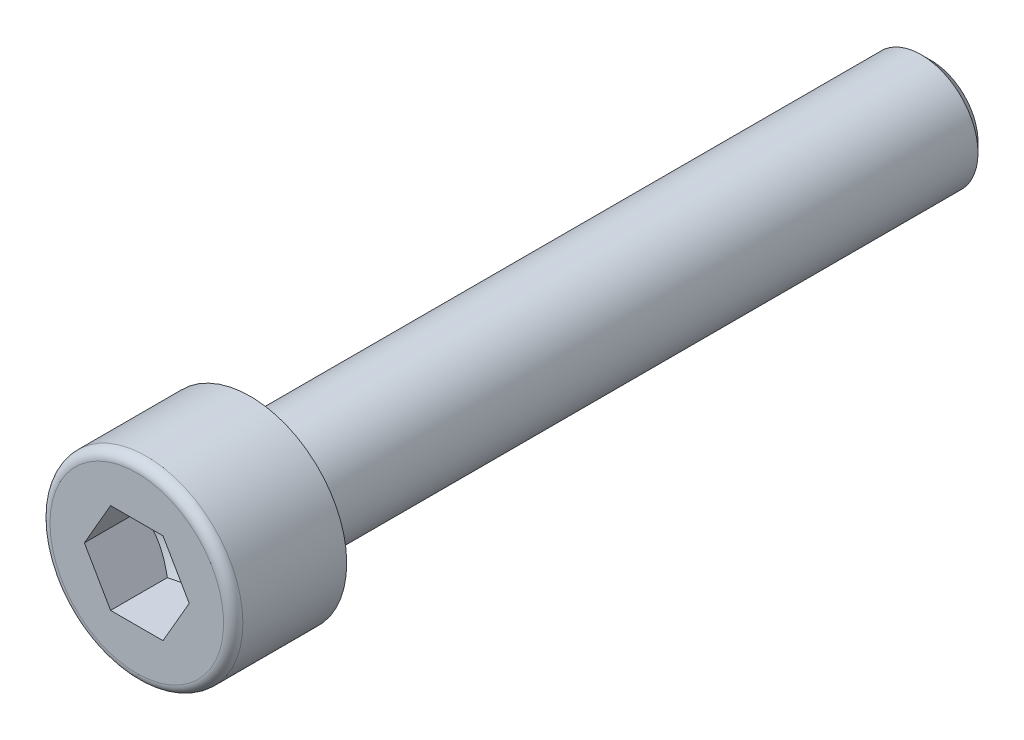
ISO-10303-21;
HEADER;
FILE_DESCRIPTION(('STEP AP214'),'2;1');
FILE_NAME('part.step','',(''),(''),'','','');
FILE_SCHEMA(('AUTOMOTIVE_DESIGN { 1 0 10303 214 1 1 1 1 }'));
ENDSEC;
DATA;
#1=APPLICATION_CONTEXT('core data for automotive mechanical design processes');
#2=APPLICATION_PROTOCOL_DEFINITION('international standard','automotive_design',2000,#1);
#3=PRODUCT_CONTEXT('',#1,'mechanical');
#4=PRODUCT('Part','Part','',(#3));
#5=PRODUCT_RELATED_PRODUCT_CATEGORY('part','',(#4));
#6=PRODUCT_DEFINITION_FORMATION('','',#4);
#7=PRODUCT_DEFINITION_CONTEXT('part definition',#1,'design');
#8=PRODUCT_DEFINITION('design','',#6,#7);
#9=PRODUCT_DEFINITION_SHAPE('','',#8);
#10=(LENGTH_UNIT() NAMED_UNIT(*) SI_UNIT(.MILLI.,.METRE.));
#11=(NAMED_UNIT(*) PLANE_ANGLE_UNIT() SI_UNIT($,.RADIAN.));
#12=(NAMED_UNIT(*) SI_UNIT($,.STERADIAN.) SOLID_ANGLE_UNIT());
#13=UNCERTAINTY_MEASURE_WITH_UNIT(LENGTH_MEASURE(1.E-05),#10,'distance_accuracy_value','');
#14=(GEOMETRIC_REPRESENTATION_CONTEXT(3) GLOBAL_UNCERTAINTY_ASSIGNED_CONTEXT((#13)) GLOBAL_UNIT_ASSIGNED_CONTEXT((#10,
#11,#12)) REPRESENTATION_CONTEXT('',''));
#15=CARTESIAN_POINT('',(0.,0.,0.));
#16=DIRECTION('',(0.,0.,1.));
#17=DIRECTION('',(1.,0.,0.));
#18=AXIS2_PLACEMENT_3D('',#15,#16,#17);
#19=CARTESIAN_POINT('',(0.,3.825,5.));
#20=DIRECTION('',(0.,0.,-1.));
#21=DIRECTION('',(-1.,0.,0.));
#22=AXIS2_PLACEMENT_3D('',#19,#20,#21);
#23=PLANE('',#22);
#24=CARTESIAN_POINT('',(0.,0.,5.));
#25=DIRECTION('',(0.,0.,-1.));
#26=DIRECTION('',(-1.,0.,0.));
#27=AXIS2_PLACEMENT_3D('',#24,#25,#26);
#28=CIRCLE('',#27,3.825);
#29=CARTESIAN_POINT('',(-3.825,0.,5.));
#30=VERTEX_POINT('',#29);
#31=EDGE_CURVE('E51',#30,#30,#28,.F.);
#32=ORIENTED_EDGE('',*,*,#31,.T.);
#33=EDGE_LOOP('',(#32));
#34=FACE_BOUND('',#33,.T.);
#35=DIRECTION('',(0.5,-0.866025403784439,0.));
#36=VECTOR('',#35,1.);
#37=CARTESIAN_POINT('',(1.1547,1.99999906749978,5.));
#38=LINE('',#37,#36);
#39=CARTESIAN_POINT('',(1.1547,1.99999906749978,5.));
#40=VERTEX_POINT('',#39);
#41=CARTESIAN_POINT('',(2.3094,0.,5.));
#42=VERTEX_POINT('',#41);
#43=EDGE_CURVE('E58',#40,#42,#38,.T.);
#44=ORIENTED_EDGE('',*,*,#43,.T.);
#45=DIRECTION('',(-0.5,-0.866025403784439,0.));
#46=VECTOR('',#45,1.);
#47=CARTESIAN_POINT('',(2.3094,0.,5.));
#48=LINE('',#47,#46);
#49=CARTESIAN_POINT('',(1.1547,-1.99999906749978,5.));
#50=VERTEX_POINT('',#49);
#51=EDGE_CURVE('E190',#42,#50,#48,.T.);
#52=ORIENTED_EDGE('',*,*,#51,.T.);
#53=DIRECTION('',(-1.,0.,0.));
#54=VECTOR('',#53,1.);
#55=CARTESIAN_POINT('',(1.1547,-1.99999906749978,5.));
#56=LINE('',#55,#54);
#57=CARTESIAN_POINT('',(-1.1547,-1.99999906749978,5.));
#58=VERTEX_POINT('',#57);
#59=EDGE_CURVE('E466',#50,#58,#56,.T.);
#60=ORIENTED_EDGE('',*,*,#59,.T.);
#61=DIRECTION('',(-0.5,0.866025403784439,0.));
#62=VECTOR('',#61,1.);
#63=CARTESIAN_POINT('',(-1.1547,-1.99999906749978,5.));
#64=LINE('',#63,#62);
#65=CARTESIAN_POINT('',(-2.3094,0.,5.));
#66=VERTEX_POINT('',#65);
#67=EDGE_CURVE('E472',#58,#66,#64,.T.);
#68=ORIENTED_EDGE('',*,*,#67,.T.);
#69=DIRECTION('',(0.5,0.866025403784439,0.));
#70=VECTOR('',#69,1.);
#71=CARTESIAN_POINT('',(-2.3094,0.,5.));
#72=LINE('',#71,#70);
#73=CARTESIAN_POINT('',(-1.1547,1.99999906749978,5.));
#74=VERTEX_POINT('',#73);
#75=EDGE_CURVE('E129',#66,#74,#72,.T.);
#76=ORIENTED_EDGE('',*,*,#75,.T.);
#77=DIRECTION('',(1.,0.,0.));
#78=VECTOR('',#77,1.);
#79=CARTESIAN_POINT('',(-1.1547,1.99999906749978,5.));
#80=LINE('',#79,#78);
#81=EDGE_CURVE('E121',#74,#40,#80,.T.);
#82=ORIENTED_EDGE('',*,*,#81,.T.);
#83=EDGE_LOOP('',(#44,#52,#60,#68,#76,#82));
#84=FACE_BOUND('',#83,.T.);
#85=ADVANCED_FACE('F43',(#34,#84),#23,.F.);
#86=CARTESIAN_POINT('',(0.,0.,0.));
#87=DIRECTION('',(0.,0.,1.));
#88=DIRECTION('',(1.,0.,0.));
#89=AXIS2_PLACEMENT_3D('',#86,#87,#88);
#90=PLANE('',#89);
#91=CARTESIAN_POINT('',(0.,0.,0.));
#92=DIRECTION('',(0.,0.,1.));
#93=DIRECTION('',(1.,0.,0.));
#94=AXIS2_PLACEMENT_3D('',#91,#92,#93);
#95=CIRCLE('',#94,4.25);
#96=CARTESIAN_POINT('',(4.25,0.,0.));
#97=VERTEX_POINT('',#96);
#98=EDGE_CURVE('E145',#97,#97,#95,.T.);
#99=ORIENTED_EDGE('',*,*,#98,.F.);
#100=EDGE_LOOP('',(#99));
#101=FACE_BOUND('',#100,.T.);
#102=CARTESIAN_POINT('',(0.,0.,0.));
#103=DIRECTION('',(0.,0.,1.));
#104=DIRECTION('',(1.,0.,0.));
#105=AXIS2_PLACEMENT_3D('',#102,#103,#104);
#106=CIRCLE('',#105,2.5);
#107=CARTESIAN_POINT('',(2.5,0.,0.));
#108=VERTEX_POINT('',#107);
#109=EDGE_CURVE('E150',#108,#108,#106,.F.);
#110=ORIENTED_EDGE('',*,*,#109,.F.);
#111=EDGE_LOOP('',(#110));
#112=FACE_BOUND('',#111,.T.);
#113=ADVANCED_FACE('F245',(#101,#112),#90,.F.);
#114=CARTESIAN_POINT('',(0.,0.,5.));
#115=DIRECTION('',(0.,0.,1.));
#116=DIRECTION('',(1.,0.,0.));
#117=AXIS2_PLACEMENT_3D('',#114,#115,#116);
#118=CYLINDRICAL_SURFACE('',#117,4.25);
#119=CARTESIAN_POINT('',(0.,0.,4.575));
#120=DIRECTION('',(0.,0.,-1.));
#121=DIRECTION('',(-1.,0.,0.));
#122=AXIS2_PLACEMENT_3D('',#119,#120,#121);
#123=CIRCLE('',#122,4.25);
#124=CARTESIAN_POINT('',(-4.25,0.,4.575));
#125=VERTEX_POINT('',#124);
#126=EDGE_CURVE('E12',#125,#125,#123,.T.);
#127=ORIENTED_EDGE('',*,*,#126,.T.);
#128=EDGE_LOOP('',(#127));
#129=FACE_BOUND('',#128,.T.);
#130=ORIENTED_EDGE('',*,*,#98,.T.);
#131=EDGE_LOOP('',(#130));
#132=FACE_BOUND('',#131,.T.);
#133=ADVANCED_FACE('F251',(#129,#132),#118,.T.);
#134=CARTESIAN_POINT('',(0.,0.,0.));
#135=DIRECTION('',(0.,0.,1.));
#136=DIRECTION('',(1.,0.,0.));
#137=AXIS2_PLACEMENT_3D('',#134,#135,#136);
#138=CYLINDRICAL_SURFACE('',#137,2.5);
#139=ORIENTED_EDGE('',*,*,#109,.T.);
#140=EDGE_LOOP('',(#139));
#141=FACE_BOUND('',#140,.T.);
#142=CARTESIAN_POINT('',(0.,0.,-29.567));
#143=DIRECTION('',(0.,0.,-1.));
#144=DIRECTION('',(-1.,0.,0.));
#145=AXIS2_PLACEMENT_3D('',#142,#143,#144);
#146=CIRCLE('',#145,2.5);
#147=CARTESIAN_POINT('',(-2.5,0.,-29.567));
#148=VERTEX_POINT('',#147);
#149=EDGE_CURVE('E270',#148,#148,#146,.F.);
#150=ORIENTED_EDGE('',*,*,#149,.T.);
#151=EDGE_LOOP('',(#150));
#152=FACE_BOUND('',#151,.T.);
#153=ADVANCED_FACE('F243',(#141,#152),#138,.T.);
#154=CARTESIAN_POINT('',(1.1547,1.99999906749978,1.16666728833348));
#155=DIRECTION('',(-0.866025403784438,-0.5,0.));
#156=DIRECTION('',(-0.5,0.866025403784439,0.));
#157=AXIS2_PLACEMENT_3D('',#154,#155,#156);
#158=PLANE('',#157);
#159=DIRECTION('',(0.,0.,1.));
#160=VECTOR('',#159,1.);
#161=CARTESIAN_POINT('',(2.3094,0.,1.16666728833348));
#162=LINE('',#161,#160);
#163=CARTESIAN_POINT('',(2.3094,0.,2.5));
#164=VERTEX_POINT('',#163);
#165=EDGE_CURVE('E142',#164,#42,#162,.T.);
#166=ORIENTED_EDGE('',*,*,#165,.T.);
#167=ORIENTED_EDGE('',*,*,#43,.F.);
#168=DIRECTION('',(0.,0.,1.));
#169=VECTOR('',#168,1.);
#170=CARTESIAN_POINT('',(1.1547,1.99999906749978,1.16666728833348));
#171=LINE('',#170,#169);
#172=CARTESIAN_POINT('',(1.1547,1.99999906749978,2.5));
#173=VERTEX_POINT('',#172);
#174=EDGE_CURVE('E114',#173,#40,#171,.T.);
#175=ORIENTED_EDGE('',*,*,#174,.F.);
#176=CARTESIAN_POINT('',(2.30940115470054,-2.E-06,2.50000066666717));
#177=CARTESIAN_POINT('',(2.2586590633301,0.0878858803359065,2.4706961706999));
#178=CARTESIAN_POINT('',(2.20747896699173,0.176532407530229,2.44404525693772));
#179=CARTESIAN_POINT('',(2.10423262359364,0.355360319991423,2.39752686821321));
#180=CARTESIAN_POINT('',(2.05216454263161,0.445544881670277,2.37767584793047));
#181=CARTESIAN_POINT('',(1.94867363491875,0.624796391950368,2.3467762774357));
#182=CARTESIAN_POINT('',(1.8972667271894,0.713835767997602,2.33552204992335));
#183=CARTESIAN_POINT('',(1.79421114915164,0.89233326516239,2.32208931802634));
#184=CARTESIAN_POINT('',(1.74256285316985,0.981790737927202,2.31989968755767));
#185=CARTESIAN_POINT('',(1.64606340062569,1.14893269263626,2.32446629100991));
#186=CARTESIAN_POINT('',(1.60119776416565,1.22664225449897,2.33010127235949));
#187=CARTESIAN_POINT('',(1.51175877649126,1.38155512532854,2.34795730960129));
#188=CARTESIAN_POINT('',(1.46718573439589,1.45875789888563,2.36018445922001));
#189=CARTESIAN_POINT('',(1.37756249119973,1.61398990964047,2.39074999235722));
#190=CARTESIAN_POINT('',(1.33252362751513,1.69199950985737,2.40921788183297));
#191=CARTESIAN_POINT('',(1.2431174638359,1.84685552785963,2.45113219321949));
#192=CARTESIAN_POINT('',(1.19874901931202,1.92370392802778,2.47456877313832));
#193=CARTESIAN_POINT('',(1.15469884529946,2.00000106749979,2.50000066666717));
#194=B_SPLINE_CURVE_WITH_KNOTS('',3,(#176,#177,#178,#179,#180,#181,#182,#183,#184,#185,#186,
#187,#188,#189,#190,#191,#192,#193),.UNSPECIFIED.,.F.,.F.,(4,2,2,2,2,2,2,2,4),(0.,
0.317016021868475,0.634793841625281,0.944707629264745,1.2542409089752,1.52370869907371,
1.79342601033586,2.06912439061208,2.34428168581533),.UNSPECIFIED.);
#195=EDGE_CURVE('E106',#164,#173,#194,.T.);
#196=ORIENTED_EDGE('',*,*,#195,.F.);
#197=EDGE_LOOP('',(#166,#167,#175,#196));
#198=FACE_BOUND('',#197,.T.);
#199=ADVANCED_FACE('F115',(#198),#158,.T.);
#200=CARTESIAN_POINT('',(2.3094,0.,1.16666728833348));
#201=DIRECTION('',(-0.866025403784439,0.5,0.));
#202=DIRECTION('',(0.5,0.866025403784439,0.));
#203=AXIS2_PLACEMENT_3D('',#200,#201,#202);
#204=PLANE('',#203);
#205=DIRECTION('',(0.,0.,1.));
#206=VECTOR('',#205,1.);
#207=CARTESIAN_POINT('',(1.1547,-1.99999906749978,1.16666728833348));
#208=LINE('',#207,#206);
#209=CARTESIAN_POINT('',(1.1547,-1.99999906749978,2.5));
#210=VERTEX_POINT('',#209);
#211=EDGE_CURVE('E139',#210,#50,#208,.T.);
#212=ORIENTED_EDGE('',*,*,#211,.T.);
#213=ORIENTED_EDGE('',*,*,#51,.F.);
#214=ORIENTED_EDGE('',*,*,#165,.F.);
#215=CARTESIAN_POINT('',(1.15469884529946,-2.00000106749979,2.50000066666717));
#216=CARTESIAN_POINT('',(1.2054409366699,-1.91211318716388,2.4706961706999));
#217=CARTESIAN_POINT('',(1.25662103300827,-1.82346665996956,2.44404525693772));
#218=CARTESIAN_POINT('',(1.35986737640636,-1.64463874750836,2.39752686821321));
#219=CARTESIAN_POINT('',(1.41193545736839,-1.55445418582951,2.37767584793046));
#220=CARTESIAN_POINT('',(1.51542636508125,-1.37520267554942,2.3467762774357));
#221=CARTESIAN_POINT('',(1.5668332728106,-1.28616329950218,2.33552204992335));
#222=CARTESIAN_POINT('',(1.66988885084836,-1.10766580233739,2.32208931802633));
#223=CARTESIAN_POINT('',(1.72153714683015,-1.01820832957258,2.31989968755767));
#224=CARTESIAN_POINT('',(1.81803659937431,-0.851066374863522,2.32446629100991));
#225=CARTESIAN_POINT('',(1.86290223583435,-0.773356813000813,2.33010127235949));
#226=CARTESIAN_POINT('',(1.95234122350874,-0.618443942171244,2.34795730960128));
#227=CARTESIAN_POINT('',(1.99691426560411,-0.54124116861415,2.36018445922001));
#228=CARTESIAN_POINT('',(2.08653750880027,-0.386009157859311,2.39074999235722));
#229=CARTESIAN_POINT('',(2.13157637248487,-0.307999557642412,2.40921788183297));
#230=CARTESIAN_POINT('',(2.2209825361641,-0.153143539640155,2.45113219321949));
#231=CARTESIAN_POINT('',(2.26535098068798,-0.0762951394720057,2.47456877313831));
#232=CARTESIAN_POINT('',(2.30940115470054,1.99999999989533E-06,2.50000066666717));
#233=B_SPLINE_CURVE_WITH_KNOTS('',3,(#215,#216,#217,#218,#219,#220,#221,#222,#223,#224,#225,
#226,#227,#228,#229,#230,#231,#232),.UNSPECIFIED.,.F.,.F.,(4,2,2,2,2,2,2,2,4),(0.,
0.317016021868475,0.634793841625281,0.944707629264746,1.2542409089752,1.52370869907371,
1.79342601033586,2.06912439061208,2.34428168581533),.UNSPECIFIED.);
#234=EDGE_CURVE('E110',#210,#164,#233,.T.);
#235=ORIENTED_EDGE('',*,*,#234,.F.);
#236=EDGE_LOOP('',(#212,#213,#214,#235));
#237=FACE_BOUND('',#236,.T.);
#238=ADVANCED_FACE('F234',(#237),#204,.T.);
#239=CARTESIAN_POINT('',(1.1547,-1.99999906749978,1.16666728833348));
#240=DIRECTION('',(0.,1.,0.));
#241=DIRECTION('',(1.,0.,0.));
#242=AXIS2_PLACEMENT_3D('',#239,#240,#241);
#243=PLANE('',#242);
#244=DIRECTION('',(0.,0.,1.));
#245=VECTOR('',#244,1.);
#246=CARTESIAN_POINT('',(-1.1547,-1.99999906749978,1.16666728833348));
#247=LINE('',#246,#245);
#248=CARTESIAN_POINT('',(-1.1547,-1.99999906749978,2.5));
#249=VERTEX_POINT('',#248);
#250=EDGE_CURVE('E136',#249,#58,#247,.T.);
#251=ORIENTED_EDGE('',*,*,#250,.T.);
#252=ORIENTED_EDGE('',*,*,#59,.F.);
#253=ORIENTED_EDGE('',*,*,#211,.F.);
#254=CARTESIAN_POINT('',(-2.99028884971983,-1.99999906749978,3.24367023125859));
#255=CARTESIAN_POINT('',(-2.90392200266685,-1.99999906749978,3.20223468621355));
#256=CARTESIAN_POINT('',(-2.81734475420192,-1.99999906749978,3.16122952382548));
#257=CARTESIAN_POINT('',(-2.64365731596042,-1.99999906749978,3.08032411328961));
#258=CARTESIAN_POINT('',(-2.55654703367194,-1.99999906749978,3.04042406398872));
#259=CARTESIAN_POINT('',(-2.38118192431167,-1.99999906749978,2.96175012614929));
#260=CARTESIAN_POINT('',(-2.29292335976907,-1.99999906749978,2.92298453713559));
#261=CARTESIAN_POINT('',(-2.11566562283863,-1.99999906749978,2.84719170485446));
#262=CARTESIAN_POINT('',(-2.02666648924309,-1.99999906749978,2.81016437120063));
#263=CARTESIAN_POINT('',(-1.84544164627787,-1.99999906749978,2.73736806072605));
#264=CARTESIAN_POINT('',(-1.75319241539257,-1.99999906749978,2.70165729625577));
#265=CARTESIAN_POINT('',(-1.56757813216984,-1.99999906749978,2.6332047864779));
#266=CARTESIAN_POINT('',(-1.47421295183128,-1.99999906749978,2.60046338553241));
#267=CARTESIAN_POINT('',(-1.28643386768821,-1.99999906749978,2.538885915786));
#268=CARTESIAN_POINT('',(-1.19202295783748,-1.99999906749978,2.51004081537766));
#269=CARTESIAN_POINT('',(-1.00184812907594,-1.99999906749978,2.45724234487318));
#270=CARTESIAN_POINT('',(-0.906084552528721,-1.99999906749978,2.43328775988067));
#271=CARTESIAN_POINT('',(-0.713403648485675,-1.99999906749978,2.39154750443783));
#272=CARTESIAN_POINT('',(-0.616489120401835,-1.99999906749978,2.37374916380532));
#273=CARTESIAN_POINT('',(-0.421576462996769,-1.99999906749978,2.34548602757582));
#274=CARTESIAN_POINT('',(-0.323578407356965,-1.99999906749978,2.33502073639873));
#275=CARTESIAN_POINT('',(-0.128212352021125,-1.99999906749978,2.32239776567767));
#276=CARTESIAN_POINT('',(-0.0308508716606805,-1.99999906749978,2.32014205033526));
#277=CARTESIAN_POINT('',(0.163710831550759,-1.99999906749978,2.32386608230561));
#278=CARTESIAN_POINT('',(0.260911044043611,-1.99999906749978,2.32984633955668));
#279=CARTESIAN_POINT('',(0.500738265811493,-1.99999906749979,2.35423686692871));
#280=CARTESIAN_POINT('',(0.642900579770635,-1.99999906749978,2.37721804373175));
#281=CARTESIAN_POINT('',(0.924460633233846,-1.99999906749978,2.43647980411871));
#282=CARTESIAN_POINT('',(1.06385482642399,-1.99999906749978,2.47277641667854));
#283=CARTESIAN_POINT('',(1.27233418248367,-1.99999906749978,2.53477991339468));
#284=CARTESIAN_POINT('',(1.3424969926884,-1.99999906749978,2.55699669002916));
#285=CARTESIAN_POINT('',(1.48209226240527,-1.99999906749978,2.60348542114602));
#286=CARTESIAN_POINT('',(1.55152514771462,-1.99999906749978,2.62775609303869));
#287=CARTESIAN_POINT('',(1.68975335664335,-1.99999906749978,2.67800013448867));
#288=CARTESIAN_POINT('',(1.75854879355,-1.99999906749978,2.70397319460621));
#289=CARTESIAN_POINT('',(1.89559758268158,-1.99999906749978,2.75734107185943));
#290=CARTESIAN_POINT('',(1.9638508410586,-1.99999906749978,2.78473612920681));
#291=CARTESIAN_POINT('',(2.13806940290074,-1.99999906749978,2.85641772846815));
#292=CARTESIAN_POINT('',(2.24368635497214,-1.99999906749978,2.901550016113));
#293=CARTESIAN_POINT('',(2.45396650508346,-1.99999906749978,2.99399021983251));
#294=CARTESIAN_POINT('',(2.55862963096903,-1.99999906749978,3.04129829888963));
#295=CARTESIAN_POINT('',(2.87150608038439,-1.99999906749978,3.18571923402663));
#296=CARTESIAN_POINT('',(3.0785715280017,-1.99999906749978,3.28531398238035));
#297=CARTESIAN_POINT('',(3.49093339473319,-1.99999906749978,3.48868046682796));
#298=CARTESIAN_POINT('',(3.69622732620257,-1.99999906749978,3.5924571873));
#299=CARTESIAN_POINT('',(4.10540863094205,-1.99999906749978,3.80267906745961));
#300=CARTESIAN_POINT('',(4.30929617883657,-1.99999906749978,3.90912388796881));
#301=CARTESIAN_POINT('',(4.69689964068718,-1.99999906749978,4.11371802640448));
#302=CARTESIAN_POINT('',(4.88070311068181,-1.99999906749978,4.21170204501137));
#303=CARTESIAN_POINT('',(5.24771880693925,-1.99999906749978,4.40878651474632));
#304=CARTESIAN_POINT('',(5.43093101099718,-1.99999906749978,4.5078870071899));
#305=CARTESIAN_POINT('',(5.79643447179695,-1.99999906749978,4.70667131714161));
#306=CARTESIAN_POINT('',(5.97872688569658,-1.99999906749978,4.80635300983316));
#307=CARTESIAN_POINT('',(6.34294316034774,-1.99999906749978,5.00636518212678));
#308=CARTESIAN_POINT('',(6.52486703988709,-1.99999906749978,5.10669562750368));
#309=CARTESIAN_POINT('',(6.70665851322056,-1.99999906749978,5.2072639721148));
#310=B_SPLINE_CURVE_WITH_KNOTS('',3,(#254,#255,#256,#257,#258,#259,#260,#261,#262,#263,#264,
#265,#266,#267,#268,#269,#270,#271,#272,#273,#274,#275,#276,#277,#278,#279,#280,#281,#282,#283,
#284,#285,#286,#287,#288,#289,#290,#291,#292,#293,#294,#295,#296,#297,#298,#299,#300,#301,#302,
#303,#304,#305,#306,#307,#308,#309),.UNSPECIFIED.,.F.,.F.,(4,2,2,2,2,2,2,2,2,2,2,2,2,2,2,2,2,2,
2,2,2,2,2,2,2,2,2,4),(0.,0.287380545294455,0.574812468409966,0.863987963789068,1.15314840582959,
1.44986914395045,1.74662424938927,2.04267922006207,2.33866055535835,2.63402905460955,
2.92937759042407,3.22118738911306,3.51301525630367,3.94415234632139,4.37581014668742,
4.59657452134229,4.81720203911729,5.0377895644822,5.25841447476324,5.60294646675355,
5.94750430884218,6.63673379533742,7.32681057136868,8.01680006289313,8.64166468320951,
9.26655250331283,9.88985091588627,10.513116710133),.UNSPECIFIED.);
#311=EDGE_CURVE('E223',#249,#210,#310,.T.);
#312=ORIENTED_EDGE('',*,*,#311,.F.);
#313=EDGE_LOOP('',(#251,#252,#253,#312));
#314=FACE_BOUND('',#313,.T.);
#315=ADVANCED_FACE('F230',(#314),#243,.T.);
#316=CARTESIAN_POINT('',(-1.1547,-1.99999906749978,1.16666728833348));
#317=DIRECTION('',(0.866025403784438,0.5,0.));
#318=DIRECTION('',(0.5,-0.866025403784439,0.));
#319=AXIS2_PLACEMENT_3D('',#316,#317,#318);
#320=PLANE('',#319);
#321=DIRECTION('',(0.,0.,1.));
#322=VECTOR('',#321,1.);
#323=CARTESIAN_POINT('',(-2.3094,0.,1.16666728833348));
#324=LINE('',#323,#322);
#325=CARTESIAN_POINT('',(-2.3094,0.,2.5));
#326=VERTEX_POINT('',#325);
#327=EDGE_CURVE('E127',#326,#66,#324,.T.);
#328=ORIENTED_EDGE('',*,*,#327,.T.);
#329=ORIENTED_EDGE('',*,*,#67,.F.);
#330=ORIENTED_EDGE('',*,*,#250,.F.);
#331=CARTESIAN_POINT('',(-2.30940115470054,1.99999999948187E-06,2.50000066666717));
#332=CARTESIAN_POINT('',(-2.2586590633301,-0.0878858803359071,2.4706961706999));
#333=CARTESIAN_POINT('',(-2.20747896699173,-0.176532407530229,2.44404525693772));
#334=CARTESIAN_POINT('',(-2.10423262359364,-0.355360319991423,2.39752686821321));
#335=CARTESIAN_POINT('',(-2.05216454263161,-0.445544881670277,2.37767584793047));
#336=CARTESIAN_POINT('',(-1.94867363491875,-0.624796391950368,2.3467762774357));
#337=CARTESIAN_POINT('',(-1.8972667271894,-0.713835767997602,2.33552204992335));
#338=CARTESIAN_POINT('',(-1.79421114915164,-0.89233326516239,2.32208931802634));
#339=CARTESIAN_POINT('',(-1.74256285316985,-0.981790737927202,2.31989968755767));
#340=CARTESIAN_POINT('',(-1.64606340062569,-1.14893269263626,2.32446629100991));
#341=CARTESIAN_POINT('',(-1.60119776416565,-1.22664225449897,2.33010127235949));
#342=CARTESIAN_POINT('',(-1.51175877649126,-1.38155512532854,2.34795730960129));
#343=CARTESIAN_POINT('',(-1.46718573439589,-1.45875789888563,2.36018445922001));
#344=CARTESIAN_POINT('',(-1.37756249119973,-1.61398990964047,2.39074999235722));
#345=CARTESIAN_POINT('',(-1.33252362751513,-1.69199950985737,2.40921788183298));
#346=CARTESIAN_POINT('',(-1.2431174638359,-1.84685552785963,2.4511321932195));
#347=CARTESIAN_POINT('',(-1.19874901931202,-1.92370392802778,2.47456877313832));
#348=CARTESIAN_POINT('',(-1.15469884529946,-2.00000106749979,2.50000066666717));
#349=B_SPLINE_CURVE_WITH_KNOTS('',3,(#331,#332,#333,#334,#335,#336,#337,#338,#339,#340,#341,
#342,#343,#344,#345,#346,#347,#348),.UNSPECIFIED.,.F.,.F.,(4,2,2,2,2,2,2,2,4),(0.,
0.317016021868474,0.63479384162528,0.944707629264745,1.2542409089752,1.52370869907371,
1.79342601033586,2.06912439061208,2.34428168581533),.UNSPECIFIED.);
#350=EDGE_CURVE('E217',#326,#249,#349,.T.);
#351=ORIENTED_EDGE('',*,*,#350,.F.);
#352=EDGE_LOOP('',(#328,#329,#330,#351));
#353=FACE_BOUND('',#352,.T.);
#354=ADVANCED_FACE('F233',(#353),#320,.T.);
#355=CARTESIAN_POINT('',(-2.3094,0.,1.16666728833348));
#356=DIRECTION('',(0.866025403784439,-0.5,0.));
#357=DIRECTION('',(-0.5,-0.866025403784439,0.));
#358=AXIS2_PLACEMENT_3D('',#355,#356,#357);
#359=PLANE('',#358);
#360=DIRECTION('',(0.,0.,1.));
#361=VECTOR('',#360,1.);
#362=CARTESIAN_POINT('',(-1.1547,1.99999906749978,1.16666728833348));
#363=LINE('',#362,#361);
#364=CARTESIAN_POINT('',(-1.1547,1.99999906749978,2.5));
#365=VERTEX_POINT('',#364);
#366=EDGE_CURVE('E120',#365,#74,#363,.T.);
#367=ORIENTED_EDGE('',*,*,#366,.T.);
#368=ORIENTED_EDGE('',*,*,#75,.F.);
#369=ORIENTED_EDGE('',*,*,#327,.F.);
#370=CARTESIAN_POINT('',(-1.15469884529946,2.00000106749979,2.50000066666717));
#371=CARTESIAN_POINT('',(-1.2054409366699,1.91211318716388,2.4706961706999));
#372=CARTESIAN_POINT('',(-1.25662103300827,1.82346665996956,2.44404525693772));
#373=CARTESIAN_POINT('',(-1.35986737640636,1.64463874750836,2.39752686821321));
#374=CARTESIAN_POINT('',(-1.41193545736839,1.55445418582951,2.37767584793046));
#375=CARTESIAN_POINT('',(-1.51542636508125,1.37520267554942,2.3467762774357));
#376=CARTESIAN_POINT('',(-1.5668332728106,1.28616329950218,2.33552204992335));
#377=CARTESIAN_POINT('',(-1.66988885084836,1.10766580233739,2.32208931802633));
#378=CARTESIAN_POINT('',(-1.72153714683015,1.01820832957258,2.31989968755767));
#379=CARTESIAN_POINT('',(-1.81803659937431,0.851066374863522,2.32446629100991));
#380=CARTESIAN_POINT('',(-1.86290223583435,0.773356813000812,2.33010127235949));
#381=CARTESIAN_POINT('',(-1.95234122350874,0.618443942171244,2.34795730960128));
#382=CARTESIAN_POINT('',(-1.99691426560411,0.54124116861415,2.36018445922001));
#383=CARTESIAN_POINT('',(-2.08653750880027,0.38600915785931,2.39074999235722));
#384=CARTESIAN_POINT('',(-2.13157637248487,0.307999557642411,2.40921788183297));
#385=CARTESIAN_POINT('',(-2.2209825361641,0.153143539640155,2.45113219321949));
#386=CARTESIAN_POINT('',(-2.26535098068798,0.0762951394720053,2.47456877313832));
#387=CARTESIAN_POINT('',(-2.30940115470054,-2.0000000006804E-06,2.50000066666717));
#388=B_SPLINE_CURVE_WITH_KNOTS('',3,(#370,#371,#372,#373,#374,#375,#376,#377,#378,#379,#380,
#381,#382,#383,#384,#385,#386,#387),.UNSPECIFIED.,.F.,.F.,(4,2,2,2,2,2,2,2,4),(0.,
0.317016021868475,0.634793841625281,0.944707629264747,1.2542409089752,1.52370869907372,
1.79342601033586,2.06912439061208,2.34428168581533),.UNSPECIFIED.);
#389=EDGE_CURVE('E66',#365,#326,#388,.T.);
#390=ORIENTED_EDGE('',*,*,#389,.F.);
#391=EDGE_LOOP('',(#367,#368,#369,#390));
#392=FACE_BOUND('',#391,.T.);
#393=ADVANCED_FACE('F320',(#392),#359,.T.);
#394=CARTESIAN_POINT('',(-1.1547,1.99999906749978,1.16666728833348));
#395=DIRECTION('',(0.,-1.,0.));
#396=DIRECTION('',(-1.,0.,0.));
#397=AXIS2_PLACEMENT_3D('',#394,#395,#396);
#398=PLANE('',#397);
#399=ORIENTED_EDGE('',*,*,#174,.T.);
#400=ORIENTED_EDGE('',*,*,#81,.F.);
#401=ORIENTED_EDGE('',*,*,#366,.F.);
#402=CARTESIAN_POINT('',(-2.99028884971983,1.99999906749978,3.24367023125859));
#403=CARTESIAN_POINT('',(-2.90392200266685,1.99999906749978,3.20223468621355));
#404=CARTESIAN_POINT('',(-2.81734475420192,1.99999906749978,3.16122952382548));
#405=CARTESIAN_POINT('',(-2.64365731596042,1.99999906749978,3.08032411328961));
#406=CARTESIAN_POINT('',(-2.55654703367194,1.99999906749978,3.04042406398872));
#407=CARTESIAN_POINT('',(-2.38118192431167,1.99999906749978,2.96175012614929));
#408=CARTESIAN_POINT('',(-2.29292335976907,1.99999906749978,2.92298453713559));
#409=CARTESIAN_POINT('',(-2.11566562283863,1.99999906749978,2.84719170485446));
#410=CARTESIAN_POINT('',(-2.0266664892431,1.99999906749978,2.81016437120063));
#411=CARTESIAN_POINT('',(-1.84544164627787,1.99999906749978,2.73736806072605));
#412=CARTESIAN_POINT('',(-1.75319241539257,1.99999906749978,2.70165729625577));
#413=CARTESIAN_POINT('',(-1.56757813216984,1.99999906749978,2.6332047864779));
#414=CARTESIAN_POINT('',(-1.47421295183128,1.99999906749978,2.60046338553241));
#415=CARTESIAN_POINT('',(-1.28643386768822,1.99999906749978,2.538885915786));
#416=CARTESIAN_POINT('',(-1.19202295783749,1.99999906749978,2.51004081537766));
#417=CARTESIAN_POINT('',(-1.00184812907594,1.99999906749978,2.45724234487318));
#418=CARTESIAN_POINT('',(-0.906084552528723,1.99999906749978,2.43328775988067));
#419=CARTESIAN_POINT('',(-0.713403648485677,1.99999906749978,2.39154750443783));
#420=CARTESIAN_POINT('',(-0.616489120401837,1.99999906749978,2.37374916380532));
#421=CARTESIAN_POINT('',(-0.421576462996772,1.99999906749978,2.34548602757582));
#422=CARTESIAN_POINT('',(-0.323578407356967,1.99999906749978,2.33502073639873));
#423=CARTESIAN_POINT('',(-0.128212352021127,1.99999906749978,2.32239776567767));
#424=CARTESIAN_POINT('',(-0.0308508716606827,1.99999906749978,2.32014205033526));
#425=CARTESIAN_POINT('',(0.163710831550757,1.99999906749978,2.32386608230561));
#426=CARTESIAN_POINT('',(0.260911044043609,1.99999906749978,2.32984633955668));
#427=CARTESIAN_POINT('',(0.500738265811491,1.99999906749979,2.35423686692871));
#428=CARTESIAN_POINT('',(0.642900579770633,1.99999906749978,2.37721804373175));
#429=CARTESIAN_POINT('',(0.924460633233845,1.99999906749978,2.43647980411871));
#430=CARTESIAN_POINT('',(1.06385482642399,1.99999906749978,2.47277641667854));
#431=CARTESIAN_POINT('',(1.27233418248366,1.99999906749978,2.53477991339468));
#432=CARTESIAN_POINT('',(1.3424969926884,1.99999906749978,2.55699669002916));
#433=CARTESIAN_POINT('',(1.48209226240527,1.99999906749978,2.60348542114602));
#434=CARTESIAN_POINT('',(1.55152514771462,1.99999906749978,2.62775609303869));
#435=CARTESIAN_POINT('',(1.68975335664335,1.99999906749978,2.67800013448867));
#436=CARTESIAN_POINT('',(1.75854879355,1.99999906749978,2.70397319460621));
#437=CARTESIAN_POINT('',(1.89559758268158,1.99999906749978,2.75734107185943));
#438=CARTESIAN_POINT('',(1.9638508410586,1.99999906749978,2.78473612920681));
#439=CARTESIAN_POINT('',(2.13806940290074,1.99999906749979,2.85641772846815));
#440=CARTESIAN_POINT('',(2.24368635497214,1.99999906749978,2.901550016113));
#441=CARTESIAN_POINT('',(2.45396650508346,1.99999906749978,2.99399021983251));
#442=CARTESIAN_POINT('',(2.55862963096903,1.99999906749978,3.04129829888963));
#443=CARTESIAN_POINT('',(2.87150608038439,1.99999906749978,3.18571923402663));
#444=CARTESIAN_POINT('',(3.0785715280017,1.99999906749978,3.28531398238035));
#445=CARTESIAN_POINT('',(3.49093339473319,1.99999906749978,3.48868046682796));
#446=CARTESIAN_POINT('',(3.69622732620256,1.99999906749978,3.5924571873));
#447=CARTESIAN_POINT('',(4.10540863094205,1.99999906749978,3.80267906745961));
#448=CARTESIAN_POINT('',(4.30929617883657,1.99999906749978,3.90912388796881));
#449=CARTESIAN_POINT('',(4.69689964068717,1.99999906749978,4.11371802640448));
#450=CARTESIAN_POINT('',(4.8807031106818,1.99999906749978,4.21170204501137));
#451=CARTESIAN_POINT('',(5.24771880693925,1.99999906749978,4.40878651474632));
#452=CARTESIAN_POINT('',(5.43093101099718,1.99999906749978,4.5078870071899));
#453=CARTESIAN_POINT('',(5.79643447179695,1.99999906749978,4.70667131714161));
#454=CARTESIAN_POINT('',(5.97872688569658,1.99999906749978,4.80635300983316));
#455=CARTESIAN_POINT('',(6.34294316034774,1.99999906749978,5.00636518212678));
#456=CARTESIAN_POINT('',(6.52486703988709,1.99999906749978,5.10669562750368));
#457=CARTESIAN_POINT('',(6.70665851322056,1.99999906749978,5.2072639721148));
#458=B_SPLINE_CURVE_WITH_KNOTS('',3,(#402,#403,#404,#405,#406,#407,#408,#409,#410,#411,#412,
#413,#414,#415,#416,#417,#418,#419,#420,#421,#422,#423,#424,#425,#426,#427,#428,#429,#430,#431,
#432,#433,#434,#435,#436,#437,#438,#439,#440,#441,#442,#443,#444,#445,#446,#447,#448,#449,#450,
#451,#452,#453,#454,#455,#456,#457),.UNSPECIFIED.,.F.,.F.,(4,2,2,2,2,2,2,2,2,2,2,2,2,2,2,2,2,2,
2,2,2,2,2,2,2,2,2,4),(0.,0.287380545294456,0.574812468409967,0.86398796378907,1.15314840582959,
1.44986914395045,1.74662424938927,2.04267922006207,2.33866055535835,2.63402905460955,
2.92937759042407,3.22118738911306,3.51301525630367,3.94415234632139,4.37581014668742,
4.59657452134229,4.81720203911729,5.03778956448221,5.25841447476324,5.60294646675355,
5.94750430884218,6.63673379533742,7.32681057136868,8.01680006289313,8.6416646832095,
9.26655250331282,9.88985091588626,10.513116710133),.UNSPECIFIED.);
#459=EDGE_CURVE('E107',#173,#365,#458,.F.);
#460=ORIENTED_EDGE('',*,*,#459,.F.);
#461=EDGE_LOOP('',(#399,#400,#401,#460));
#462=FACE_BOUND('',#461,.T.);
#463=ADVANCED_FACE('F102',(#462),#398,.T.);
#464=CARTESIAN_POINT('',(0.,0.,1.16666728833348));
#465=DIRECTION('',(0.,0.,1.));
#466=DIRECTION('',(1.,0.,0.));
#467=AXIS2_PLACEMENT_3D('',#464,#465,#466);
#468=CONICAL_SURFACE('',#467,0.,1.0471975511966);
#469=CARTESIAN_POINT('',(0.,0.,1.16666728833348));
#470=VERTEX_POINT('',#469);
#471=VERTEX_LOOP('',#470);
#472=FACE_BOUND('',#471,.T.);
#473=ORIENTED_EDGE('',*,*,#195,.T.);
#474=ORIENTED_EDGE('',*,*,#459,.T.);
#475=ORIENTED_EDGE('',*,*,#389,.T.);
#476=ORIENTED_EDGE('',*,*,#350,.T.);
#477=ORIENTED_EDGE('',*,*,#311,.T.);
#478=ORIENTED_EDGE('',*,*,#234,.T.);
#479=EDGE_LOOP('',(#473,#474,#475,#476,#477,#478));
#480=FACE_BOUND('',#479,.T.);
#481=ADVANCED_FACE('F99',(#472,#480),#468,.F.);
#482=CARTESIAN_POINT('',(0.,0.,4.575));
#483=DIRECTION('',(0.,0.,-1.));
#484=DIRECTION('',(-1.,0.,0.));
#485=AXIS2_PLACEMENT_3D('',#482,#483,#484);
#486=TOROIDAL_SURFACE('',#485,3.825,0.425);
#487=ORIENTED_EDGE('',*,*,#126,.F.);
#488=EDGE_LOOP('',(#487));
#489=FACE_BOUND('',#488,.T.);
#490=ORIENTED_EDGE('',*,*,#31,.F.);
#491=EDGE_LOOP('',(#490));
#492=FACE_BOUND('',#491,.T.);
#493=ADVANCED_FACE('F45',(#489,#492),#486,.T.);
#494=CARTESIAN_POINT('',(0.,0.,-30.));
#495=DIRECTION('',(0.,0.,-1.));
#496=DIRECTION('',(-1.,0.,0.));
#497=AXIS2_PLACEMENT_3D('',#494,#495,#496);
#498=PLANE('',#497);
#499=CARTESIAN_POINT('',(0.,0.,-30.));
#500=DIRECTION('',(0.,0.,-1.));
#501=DIRECTION('',(-1.,0.,0.));
#502=AXIS2_PLACEMENT_3D('',#499,#500,#501);
#503=CIRCLE('',#502,2.067);
#504=CARTESIAN_POINT('',(-2.067,0.,-30.));
#505=VERTEX_POINT('',#504);
#506=EDGE_CURVE('E267',#505,#505,#503,.T.);
#507=ORIENTED_EDGE('',*,*,#506,.T.);
#508=EDGE_LOOP('',(#507));
#509=FACE_BOUND('',#508,.T.);
#510=ADVANCED_FACE('F198',(#509),#498,.T.);
#511=CARTESIAN_POINT('',(0.,0.,-29.567));
#512=DIRECTION('',(0.,0.,1.));
#513=DIRECTION('',(1.,0.,0.));
#514=AXIS2_PLACEMENT_3D('',#511,#512,#513);
#515=CONICAL_SURFACE('',#514,2.5,0.785398163397454);
#516=ORIENTED_EDGE('',*,*,#506,.F.);
#517=EDGE_LOOP('',(#516));
#518=FACE_BOUND('',#517,.T.);
#519=ORIENTED_EDGE('',*,*,#149,.F.);
#520=EDGE_LOOP('',(#519));
#521=FACE_BOUND('',#520,.T.);
#522=ADVANCED_FACE('F257',(#518,#521),#515,.T.);
#523=CLOSED_SHELL('',(#85,#113,#133,#153,#199,#238,#315,#354,#393,#463,#481,#493,#510,#522));
#524=MANIFOLD_SOLID_BREP('B2',#523);
#525=ADVANCED_BREP_SHAPE_REPRESENTATION('',(#18,#524),#14);
#526=SHAPE_DEFINITION_REPRESENTATION(#9,#525);
ENDSEC;
END-ISO-10303-21;
